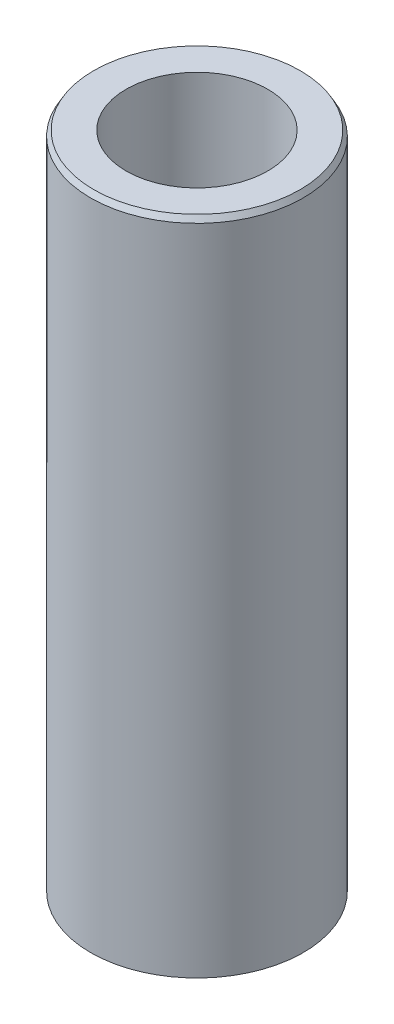
ISO-10303-21;
HEADER;
FILE_DESCRIPTION(('STEP AP214'),'2;1');
FILE_NAME('part.step','',(''),(''),'','','');
FILE_SCHEMA(('AUTOMOTIVE_DESIGN { 1 0 10303 214 1 1 1 1 }'));
ENDSEC;
DATA;
#1=APPLICATION_CONTEXT('core data for automotive mechanical design processes');
#2=APPLICATION_PROTOCOL_DEFINITION('international standard','automotive_design',2000,#1);
#3=PRODUCT_CONTEXT('',#1,'mechanical');
#4=PRODUCT('Part','Part','',(#3));
#5=PRODUCT_RELATED_PRODUCT_CATEGORY('part','',(#4));
#6=PRODUCT_DEFINITION_FORMATION('','',#4);
#7=PRODUCT_DEFINITION_CONTEXT('part definition',#1,'design');
#8=PRODUCT_DEFINITION('design','',#6,#7);
#9=PRODUCT_DEFINITION_SHAPE('','',#8);
#10=(LENGTH_UNIT() NAMED_UNIT(*) SI_UNIT(.MILLI.,.METRE.));
#11=(NAMED_UNIT(*) PLANE_ANGLE_UNIT() SI_UNIT($,.RADIAN.));
#12=(NAMED_UNIT(*) SI_UNIT($,.STERADIAN.) SOLID_ANGLE_UNIT());
#13=UNCERTAINTY_MEASURE_WITH_UNIT(LENGTH_MEASURE(1.E-05),#10,'distance_accuracy_value','');
#14=(GEOMETRIC_REPRESENTATION_CONTEXT(3) GLOBAL_UNCERTAINTY_ASSIGNED_CONTEXT((#13)) GLOBAL_UNIT_ASSIGNED_CONTEXT((#10,
#11,#12)) REPRESENTATION_CONTEXT('',''));
#15=CARTESIAN_POINT('',(0.,0.,0.));
#16=DIRECTION('',(0.,0.,1.));
#17=DIRECTION('',(1.,0.,0.));
#18=AXIS2_PLACEMENT_3D('',#15,#16,#17);
#19=CARTESIAN_POINT('',(0.,233.507473617804,0.));
#20=DIRECTION('',(0.,-1.,0.));
#21=DIRECTION('',(0.,0.,-1.));
#22=AXIS2_PLACEMENT_3D('',#19,#20,#21);
#23=CYLINDRICAL_SURFACE('',#22,37.5);
#24=CARTESIAN_POINT('',(0.,231.551044291242,0.));
#25=DIRECTION('',(0.,1.,0.));
#26=DIRECTION('',(0.,0.,1.));
#27=AXIS2_PLACEMENT_3D('',#24,#25,#26);
#28=CIRCLE('',#27,37.5);
#29=CARTESIAN_POINT('',(0.,231.551044291242,37.5));
#30=VERTEX_POINT('',#29);
#31=EDGE_CURVE('E50',#30,#30,#28,.F.);
#32=ORIENTED_EDGE('',*,*,#31,.T.);
#33=EDGE_LOOP('',(#32));
#34=FACE_BOUND('',#33,.T.);
#35=CARTESIAN_POINT('',(0.,1.12954499834103,0.));
#36=DIRECTION('',(0.,1.,0.));
#37=DIRECTION('',(0.,0.,1.));
#38=AXIS2_PLACEMENT_3D('',#35,#36,#37);
#39=CIRCLE('',#38,37.5);
#40=CARTESIAN_POINT('',(0.,1.12954499834103,37.5));
#41=VERTEX_POINT('',#40);
#42=EDGE_CURVE('E51',#41,#41,#39,.T.);
#43=ORIENTED_EDGE('',*,*,#42,.T.);
#44=EDGE_LOOP('',(#43));
#45=FACE_BOUND('',#44,.T.);
#46=ADVANCED_FACE('F39',(#34,#45),#23,.T.);
#47=CARTESIAN_POINT('',(0.,233.507473617804,0.));
#48=DIRECTION('',(0.,1.,0.));
#49=DIRECTION('',(0.,0.,1.));
#50=AXIS2_PLACEMENT_3D('',#47,#48,#49);
#51=PLANE('',#50);
#52=CARTESIAN_POINT('',(0.,233.507473617804,0.));
#53=DIRECTION('',(0.,1.,0.));
#54=DIRECTION('',(0.,0.,1.));
#55=AXIS2_PLACEMENT_3D('',#52,#53,#54);
#56=CIRCLE('',#55,36.3704550016589);
#57=CARTESIAN_POINT('',(0.,233.507473617804,36.3704550016589));
#58=VERTEX_POINT('',#57);
#59=EDGE_CURVE('E54',#58,#58,#56,.T.);
#60=ORIENTED_EDGE('',*,*,#59,.T.);
#61=EDGE_LOOP('',(#60));
#62=FACE_BOUND('',#61,.T.);
#63=CARTESIAN_POINT('',(0.,233.507473617804,0.));
#64=DIRECTION('',(0.,1.,0.));
#65=DIRECTION('',(0.,0.,1.));
#66=AXIS2_PLACEMENT_3D('',#63,#64,#65);
#67=CIRCLE('',#66,24.984423996025);
#68=CARTESIAN_POINT('',(0.,233.507473617804,24.984423996025));
#69=VERTEX_POINT('',#68);
#70=EDGE_CURVE('E58',#69,#69,#67,.T.);
#71=ORIENTED_EDGE('',*,*,#70,.F.);
#72=EDGE_LOOP('',(#71));
#73=FACE_BOUND('',#72,.T.);
#74=ADVANCED_FACE('F69',(#62,#73),#51,.T.);
#75=CARTESIAN_POINT('',(0.,0.,0.));
#76=DIRECTION('',(0.,1.,0.));
#77=DIRECTION('',(0.,0.,1.));
#78=AXIS2_PLACEMENT_3D('',#75,#76,#77);
#79=PLANE('',#78);
#80=CARTESIAN_POINT('',(0.,0.,0.));
#81=DIRECTION('',(0.,1.,0.));
#82=DIRECTION('',(0.,0.,1.));
#83=AXIS2_PLACEMENT_3D('',#80,#81,#82);
#84=CIRCLE('',#83,35.543570673438);
#85=CARTESIAN_POINT('',(0.,0.,35.543570673438));
#86=VERTEX_POINT('',#85);
#87=EDGE_CURVE('E10',#86,#86,#84,.F.);
#88=ORIENTED_EDGE('',*,*,#87,.T.);
#89=EDGE_LOOP('',(#88));
#90=FACE_BOUND('',#89,.T.);
#91=CARTESIAN_POINT('',(0.,0.,0.));
#92=DIRECTION('',(0.,1.,0.));
#93=DIRECTION('',(0.,0.,1.));
#94=AXIS2_PLACEMENT_3D('',#91,#92,#93);
#95=CIRCLE('',#94,24.984423996025);
#96=CARTESIAN_POINT('',(0.,0.,24.984423996025));
#97=VERTEX_POINT('',#96);
#98=EDGE_CURVE('E63',#97,#97,#95,.T.);
#99=ORIENTED_EDGE('',*,*,#98,.T.);
#100=EDGE_LOOP('',(#99));
#101=FACE_BOUND('',#100,.T.);
#102=ADVANCED_FACE('F75',(#90,#101),#79,.F.);
#103=CARTESIAN_POINT('',(0.,233.507473617804,0.));
#104=DIRECTION('',(0.,-1.,0.));
#105=DIRECTION('',(0.,0.,-1.));
#106=AXIS2_PLACEMENT_3D('',#103,#104,#105);
#107=CYLINDRICAL_SURFACE('',#106,24.984423996025);
#108=ORIENTED_EDGE('',*,*,#70,.T.);
#109=EDGE_LOOP('',(#108));
#110=FACE_BOUND('',#109,.T.);
#111=ORIENTED_EDGE('',*,*,#98,.F.);
#112=EDGE_LOOP('',(#111));
#113=FACE_BOUND('',#112,.T.);
#114=ADVANCED_FACE('F70',(#110,#113),#107,.F.);
#115=CARTESIAN_POINT('',(0.,233.507473617804,0.));
#116=DIRECTION('',(0.,-1.,0.));
#117=DIRECTION('',(0.,0.,-1.));
#118=AXIS2_PLACEMENT_3D('',#115,#116,#117);
#119=CONICAL_SURFACE('',#118,36.3704550016589,0.523598775598279);
#120=ORIENTED_EDGE('',*,*,#31,.F.);
#121=EDGE_LOOP('',(#120));
#122=FACE_BOUND('',#121,.T.);
#123=ORIENTED_EDGE('',*,*,#59,.F.);
#124=EDGE_LOOP('',(#123));
#125=FACE_BOUND('',#124,.T.);
#126=ADVANCED_FACE('F81',(#122,#125),#119,.T.);
#127=CARTESIAN_POINT('',(0.,1.12954499834103,0.));
#128=DIRECTION('',(0.,1.,0.));
#129=DIRECTION('',(0.,0.,1.));
#130=AXIS2_PLACEMENT_3D('',#127,#128,#129);
#131=CONICAL_SURFACE('',#130,37.5,1.0471975511966);
#132=ORIENTED_EDGE('',*,*,#87,.F.);
#133=EDGE_LOOP('',(#132));
#134=FACE_BOUND('',#133,.T.);
#135=ORIENTED_EDGE('',*,*,#42,.F.);
#136=EDGE_LOOP('',(#135));
#137=FACE_BOUND('',#136,.T.);
#138=ADVANCED_FACE('F45',(#134,#137),#131,.T.);
#139=CLOSED_SHELL('',(#46,#74,#102,#114,#126,#138));
#140=MANIFOLD_SOLID_BREP('B2',#139);
#141=ADVANCED_BREP_SHAPE_REPRESENTATION('',(#18,#140),#14);
#142=SHAPE_DEFINITION_REPRESENTATION(#9,#141);
ENDSEC;
END-ISO-10303-21;
